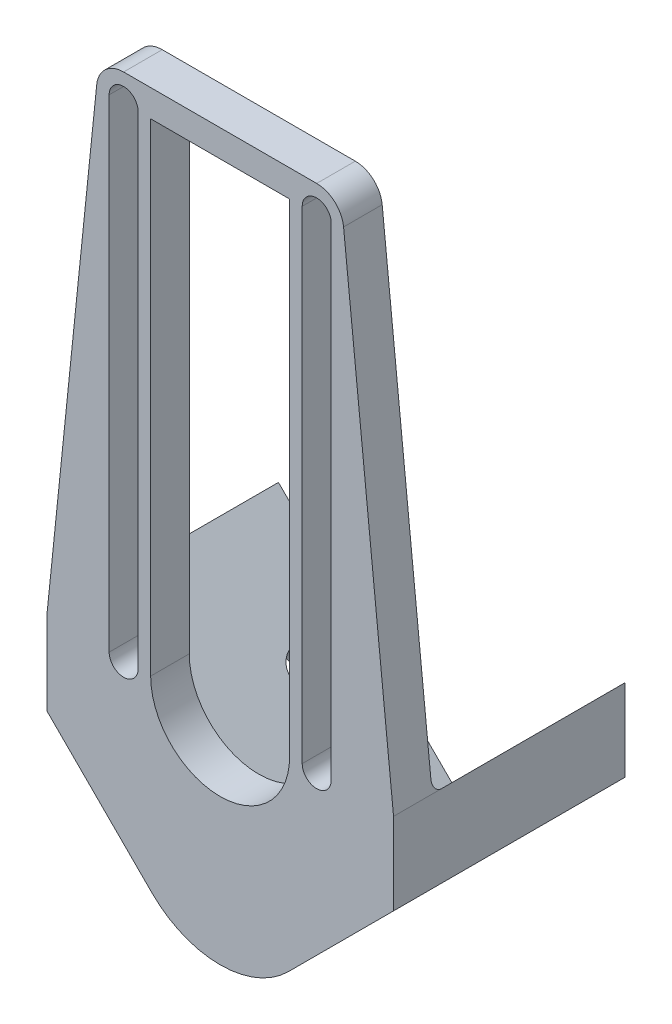
ISO-10303-21;
HEADER;
FILE_DESCRIPTION(('STEP AP214'),'2;1');
FILE_NAME('part.step','',(''),(''),'','','');
FILE_SCHEMA(('AUTOMOTIVE_DESIGN { 1 0 10303 214 1 1 1 1 }'));
ENDSEC;
DATA;
#1=APPLICATION_CONTEXT('core data for automotive mechanical design processes');
#2=APPLICATION_PROTOCOL_DEFINITION('international standard','automotive_design',2000,#1);
#3=PRODUCT_CONTEXT('',#1,'mechanical');
#4=PRODUCT('Part','Part','',(#3));
#5=PRODUCT_RELATED_PRODUCT_CATEGORY('part','',(#4));
#6=PRODUCT_DEFINITION_FORMATION('','',#4);
#7=PRODUCT_DEFINITION_CONTEXT('part definition',#1,'design');
#8=PRODUCT_DEFINITION('design','',#6,#7);
#9=PRODUCT_DEFINITION_SHAPE('','',#8);
#10=(LENGTH_UNIT() NAMED_UNIT(*) SI_UNIT(.MILLI.,.METRE.));
#11=(NAMED_UNIT(*) PLANE_ANGLE_UNIT() SI_UNIT($,.RADIAN.));
#12=(NAMED_UNIT(*) SI_UNIT($,.STERADIAN.) SOLID_ANGLE_UNIT());
#13=UNCERTAINTY_MEASURE_WITH_UNIT(LENGTH_MEASURE(1.E-05),#10,'distance_accuracy_value','');
#14=(GEOMETRIC_REPRESENTATION_CONTEXT(3) GLOBAL_UNCERTAINTY_ASSIGNED_CONTEXT((#13)) GLOBAL_UNIT_ASSIGNED_CONTEXT((#10,
#11,#12)) REPRESENTATION_CONTEXT('',''));
#15=CARTESIAN_POINT('',(0.,0.,0.));
#16=DIRECTION('',(0.,0.,1.));
#17=DIRECTION('',(1.,0.,0.));
#18=AXIS2_PLACEMENT_3D('',#15,#16,#17);
#19=CARTESIAN_POINT('',(-16.8228968081884,1.1376154339499,-14.));
#20=DIRECTION('',(0.707106781186548,0.707106781186546,0.));
#21=DIRECTION('',(-0.707106781186547,0.707106781186549,0.));
#22=AXIS2_PLACEMENT_3D('',#19,#20,#21);
#23=CYLINDRICAL_SURFACE('',#22,1.8);
#24=CARTESIAN_POINT('',(-8.98025612106914,8.98025612106917,-14.));
#25=DIRECTION('',(0.707106781186549,0.707106781186546,0.));
#26=DIRECTION('',(-0.707106781186546,0.707106781186549,0.));
#27=AXIS2_PLACEMENT_3D('',#24,#25,#26);
#28=CIRCLE('',#27,1.8);
#29=CARTESIAN_POINT('',(-10.2530483272049,10.253048327205,-14.));
#30=VERTEX_POINT('',#29);
#31=EDGE_CURVE('E414',#30,#30,#28,.T.);
#32=ORIENTED_EDGE('',*,*,#31,.T.);
#33=EDGE_LOOP('',(#32));
#34=FACE_BOUND('',#33,.T.);
#35=CARTESIAN_POINT('',(-10.3944696834422,7.56604255869607,-14.));
#36=DIRECTION('',(-0.707106781186549,-0.707106781186546,0.));
#37=DIRECTION('',(0.707106781186546,-0.707106781186549,0.));
#38=AXIS2_PLACEMENT_3D('',#35,#36,#37);
#39=CIRCLE('',#38,1.8);
#40=CARTESIAN_POINT('',(-9.12167747730645,6.29325035256029,-14.));
#41=VERTEX_POINT('',#40);
#42=EDGE_CURVE('E40',#41,#41,#39,.F.);
#43=ORIENTED_EDGE('',*,*,#42,.F.);
#44=EDGE_LOOP('',(#43));
#45=FACE_BOUND('',#44,.T.);
#46=ADVANCED_FACE('F36',(#34,#45),#23,.F.);
#47=CARTESIAN_POINT('',(16.8228968081884,1.1376154339499,-14.));
#48=DIRECTION('',(-0.707106781186548,0.707106781186546,0.));
#49=DIRECTION('',(-0.707106781186547,-0.707106781186549,0.));
#50=AXIS2_PLACEMENT_3D('',#47,#48,#49);
#51=CYLINDRICAL_SURFACE('',#50,1.8);
#52=CARTESIAN_POINT('',(8.98025612106914,8.98025612106917,-14.));
#53=DIRECTION('',(-0.707106781186549,0.707106781186546,0.));
#54=DIRECTION('',(-0.707106781186546,-0.707106781186549,0.));
#55=AXIS2_PLACEMENT_3D('',#52,#53,#54);
#56=CIRCLE('',#55,1.8);
#57=CARTESIAN_POINT('',(7.70746391493336,7.70746391493338,-14.));
#58=VERTEX_POINT('',#57);
#59=EDGE_CURVE('E420',#58,#58,#56,.T.);
#60=ORIENTED_EDGE('',*,*,#59,.T.);
#61=EDGE_LOOP('',(#60));
#62=FACE_BOUND('',#61,.T.);
#63=CARTESIAN_POINT('',(10.3944696834422,7.56604255869607,-14.));
#64=DIRECTION('',(0.707106781186549,-0.707106781186546,0.));
#65=DIRECTION('',(0.707106781186546,0.707106781186549,0.));
#66=AXIS2_PLACEMENT_3D('',#63,#64,#65);
#67=CIRCLE('',#66,1.8);
#68=CARTESIAN_POINT('',(11.667261889578,8.83883476483186,-14.));
#69=VERTEX_POINT('',#68);
#70=EDGE_CURVE('E418',#69,#69,#67,.F.);
#71=ORIENTED_EDGE('',*,*,#70,.F.);
#72=EDGE_LOOP('',(#71));
#73=FACE_BOUND('',#72,.T.);
#74=ADVANCED_FACE('F445',(#62,#73),#51,.F.);
#75=CARTESIAN_POINT('',(0.,0.,-20.));
#76=DIRECTION('',(0.707106781186549,0.707106781186546,0.));
#77=DIRECTION('',(-0.707106781186546,0.707106781186549,0.));
#78=AXIS2_PLACEMENT_3D('',#75,#76,#77);
#79=PLANE('',#78);
#80=ORIENTED_EDGE('',*,*,#31,.F.);
#81=EDGE_LOOP('',(#80));
#82=FACE_BOUND('',#81,.T.);
#83=DIRECTION('',(0.,0.,1.));
#84=VECTOR('',#83,1.);
#85=CARTESIAN_POINT('',(-17.9605122421383,17.9605122421383,-20.));
#86=LINE('',#85,#84);
#87=CARTESIAN_POINT('',(-17.9605122421383,17.9605122421383,-20.));
#88=VERTEX_POINT('',#87);
#89=CARTESIAN_POINT('',(-17.9605122421383,17.9605122421383,-1.));
#90=VERTEX_POINT('',#89);
#91=EDGE_CURVE('E383',#88,#90,#86,.T.);
#92=ORIENTED_EDGE('',*,*,#91,.T.);
#93=DIRECTION('',(-0.707106781186546,0.707106781186549,0.));
#94=VECTOR('',#93,1.);
#95=CARTESIAN_POINT('',(0.,0.,-1.));
#96=LINE('',#95,#94);
#97=CARTESIAN_POINT('',(0.,0.,-1.));
#98=VERTEX_POINT('',#97);
#99=EDGE_CURVE('E401',#90,#98,#96,.F.);
#100=ORIENTED_EDGE('',*,*,#99,.T.);
#101=DIRECTION('',(0.,0.,1.));
#102=VECTOR('',#101,1.);
#103=CARTESIAN_POINT('',(0.,0.,-20.));
#104=LINE('',#103,#102);
#105=CARTESIAN_POINT('',(0.,0.,-20.));
#106=VERTEX_POINT('',#105);
#107=EDGE_CURVE('E384',#106,#98,#104,.T.);
#108=ORIENTED_EDGE('',*,*,#107,.F.);
#109=DIRECTION('',(-0.707106781186546,0.707106781186549,0.));
#110=VECTOR('',#109,1.);
#111=CARTESIAN_POINT('',(0.,0.,-20.));
#112=LINE('',#111,#110);
#113=EDGE_CURVE('E341',#106,#88,#112,.T.);
#114=ORIENTED_EDGE('',*,*,#113,.T.);
#115=EDGE_LOOP('',(#92,#100,#108,#114));
#116=FACE_BOUND('',#115,.T.);
#117=ADVANCED_FACE('F441',(#82,#116),#79,.T.);
#118=CARTESIAN_POINT('',(0.,0.,-20.));
#119=DIRECTION('',(0.707106781186549,-0.707106781186546,0.));
#120=DIRECTION('',(0.707106781186546,0.707106781186549,0.));
#121=AXIS2_PLACEMENT_3D('',#118,#119,#120);
#122=PLANE('',#121);
#123=ORIENTED_EDGE('',*,*,#59,.F.);
#124=EDGE_LOOP('',(#123));
#125=FACE_BOUND('',#124,.T.);
#126=ORIENTED_EDGE('',*,*,#107,.T.);
#127=DIRECTION('',(0.707106781186546,0.707106781186549,0.));
#128=VECTOR('',#127,1.);
#129=CARTESIAN_POINT('',(17.9605122421383,17.9605122421383,-1.));
#130=LINE('',#129,#128);
#131=CARTESIAN_POINT('',(17.9605122421383,17.9605122421383,-1.));
#132=VERTEX_POINT('',#131);
#133=EDGE_CURVE('E403',#98,#132,#130,.T.);
#134=ORIENTED_EDGE('',*,*,#133,.T.);
#135=DIRECTION('',(0.,0.,1.));
#136=VECTOR('',#135,1.);
#137=CARTESIAN_POINT('',(17.9605122421383,17.9605122421383,-20.));
#138=LINE('',#137,#136);
#139=CARTESIAN_POINT('',(17.9605122421383,17.9605122421383,-20.));
#140=VERTEX_POINT('',#139);
#141=EDGE_CURVE('E388',#140,#132,#138,.T.);
#142=ORIENTED_EDGE('',*,*,#141,.F.);
#143=DIRECTION('',(0.707106781186546,0.707106781186549,0.));
#144=VECTOR('',#143,1.);
#145=CARTESIAN_POINT('',(0.,0.,-20.));
#146=LINE('',#145,#144);
#147=EDGE_CURVE('E381',#106,#140,#146,.T.);
#148=ORIENTED_EDGE('',*,*,#147,.F.);
#149=EDGE_LOOP('',(#126,#134,#142,#148));
#150=FACE_BOUND('',#149,.T.);
#151=ADVANCED_FACE('F444',(#125,#150),#122,.F.);
#152=CARTESIAN_POINT('',(17.9605122421383,0.,-20.));
#153=DIRECTION('',(-1.,0.,0.));
#154=DIRECTION('',(0.,0.,1.));
#155=AXIS2_PLACEMENT_3D('',#152,#153,#154);
#156=PLANE('',#155);
#157=ORIENTED_EDGE('',*,*,#141,.T.);
#158=DIRECTION('',(0.,0.,-1.));
#159=VECTOR('',#158,1.);
#160=CARTESIAN_POINT('',(17.9605122421383,17.9605122421383,4.));
#161=LINE('',#160,#159);
#162=CARTESIAN_POINT('',(17.9605122421383,17.9605122421383,4.));
#163=VERTEX_POINT('',#162);
#164=EDGE_CURVE('E361',#163,#132,#161,.T.);
#165=ORIENTED_EDGE('',*,*,#164,.F.);
#166=DIRECTION('',(0.,-1.,0.));
#167=VECTOR('',#166,1.);
#168=CARTESIAN_POINT('',(17.9605122421383,0.,4.));
#169=LINE('',#168,#167);
#170=CARTESIAN_POINT('',(17.9605122421383,9.47523086789976,4.));
#171=VERTEX_POINT('',#170);
#172=EDGE_CURVE('E250',#163,#171,#169,.T.);
#173=ORIENTED_EDGE('',*,*,#172,.T.);
#174=DIRECTION('',(0.,0.,1.));
#175=VECTOR('',#174,1.);
#176=CARTESIAN_POINT('',(17.9605122421383,9.47523086789976,-20.));
#177=LINE('',#176,#175);
#178=CARTESIAN_POINT('',(17.9605122421383,9.47523086789976,-20.));
#179=VERTEX_POINT('',#178);
#180=EDGE_CURVE('E391',#179,#171,#177,.T.);
#181=ORIENTED_EDGE('',*,*,#180,.F.);
#182=DIRECTION('',(0.,-1.,0.));
#183=VECTOR('',#182,1.);
#184=CARTESIAN_POINT('',(17.9605122421383,0.,-20.));
#185=LINE('',#184,#183);
#186=EDGE_CURVE('E379',#140,#179,#185,.T.);
#187=ORIENTED_EDGE('',*,*,#186,.F.);
#188=EDGE_LOOP('',(#157,#165,#173,#181,#187));
#189=FACE_BOUND('',#188,.T.);
#190=ADVANCED_FACE('F469',(#189),#156,.F.);
#191=CARTESIAN_POINT('',(4.24264068711929,-4.24264068711928,-20.));
#192=DIRECTION('',(-0.707106781186549,0.707106781186546,0.));
#193=DIRECTION('',(-0.707106781186546,-0.707106781186549,0.));
#194=AXIS2_PLACEMENT_3D('',#191,#192,#193);
#195=PLANE('',#194);
#196=CARTESIAN_POINT('',(13.2228968081884,4.73761543394989,-14.));
#197=DIRECTION('',(0.707106781186549,-0.707106781186546,0.));
#198=DIRECTION('',(0.707106781186546,0.707106781186549,0.));
#199=AXIS2_PLACEMENT_3D('',#196,#197,#198);
#200=CIRCLE('',#199,3.2);
#201=CARTESIAN_POINT('',(15.4856385079854,7.00035713374685,-14.));
#202=VERTEX_POINT('',#201);
#203=EDGE_CURVE('E427',#202,#202,#200,.T.);
#204=ORIENTED_EDGE('',*,*,#203,.F.);
#205=EDGE_LOOP('',(#204));
#206=FACE_BOUND('',#205,.T.);
#207=DIRECTION('',(-0.707106781186546,-0.707106781186549,0.));
#208=VECTOR('',#207,1.);
#209=CARTESIAN_POINT('',(4.24264068711929,-4.24264068711928,4.));
#210=LINE('',#209,#208);
#211=CARTESIAN_POINT('',(7.07106781186549,-1.41421356237307,4.));
#212=VERTEX_POINT('',#211);
#213=EDGE_CURVE('E248',#171,#212,#210,.T.);
#214=ORIENTED_EDGE('',*,*,#213,.T.);
#215=DIRECTION('',(0.,0.,1.));
#216=VECTOR('',#215,1.);
#217=CARTESIAN_POINT('',(7.07106781186549,-1.41421356237307,-20.));
#218=LINE('',#217,#216);
#219=CARTESIAN_POINT('',(7.07106781186549,-1.41421356237307,-20.));
#220=VERTEX_POINT('',#219);
#221=EDGE_CURVE('E45',#212,#220,#218,.F.);
#222=ORIENTED_EDGE('',*,*,#221,.T.);
#223=DIRECTION('',(-0.707106781186546,-0.707106781186549,0.));
#224=VECTOR('',#223,1.);
#225=CARTESIAN_POINT('',(4.24264068711929,-4.24264068711928,-20.));
#226=LINE('',#225,#224);
#227=EDGE_CURVE('E377',#179,#220,#226,.T.);
#228=ORIENTED_EDGE('',*,*,#227,.F.);
#229=ORIENTED_EDGE('',*,*,#180,.T.);
#230=EDGE_LOOP('',(#214,#222,#228,#229));
#231=FACE_BOUND('',#230,.T.);
#232=ADVANCED_FACE('F575',(#206,#231),#195,.F.);
#233=CARTESIAN_POINT('',(-4.24264068711929,-4.24264068711928,-20.));
#234=DIRECTION('',(-0.707106781186549,-0.707106781186546,0.));
#235=DIRECTION('',(0.707106781186546,-0.707106781186549,0.));
#236=AXIS2_PLACEMENT_3D('',#233,#234,#235);
#237=PLANE('',#236);
#238=CARTESIAN_POINT('',(-13.2228968081884,4.73761543394989,-14.));
#239=DIRECTION('',(-0.707106781186549,-0.707106781186546,0.));
#240=DIRECTION('',(0.707106781186546,-0.707106781186549,0.));
#241=AXIS2_PLACEMENT_3D('',#238,#239,#240);
#242=CIRCLE('',#241,3.2);
#243=CARTESIAN_POINT('',(-10.9601551083915,2.47487373415294,-14.));
#244=VERTEX_POINT('',#243);
#245=EDGE_CURVE('E434',#244,#244,#242,.T.);
#246=ORIENTED_EDGE('',*,*,#245,.F.);
#247=EDGE_LOOP('',(#246));
#248=FACE_BOUND('',#247,.T.);
#249=DIRECTION('',(0.707106781186546,-0.707106781186549,0.));
#250=VECTOR('',#249,1.);
#251=CARTESIAN_POINT('',(-4.24264068711929,-4.24264068711928,-20.));
#252=LINE('',#251,#250);
#253=CARTESIAN_POINT('',(-17.9605122421383,9.47523086789976,-20.));
#254=VERTEX_POINT('',#253);
#255=CARTESIAN_POINT('',(-7.07106781186549,-1.41421356237307,-20.));
#256=VERTEX_POINT('',#255);
#257=EDGE_CURVE('E374',#254,#256,#252,.T.);
#258=ORIENTED_EDGE('',*,*,#257,.T.);
#259=DIRECTION('',(0.,0.,1.));
#260=VECTOR('',#259,1.);
#261=CARTESIAN_POINT('',(-7.07106781186549,-1.41421356237307,4.));
#262=LINE('',#261,#260);
#263=CARTESIAN_POINT('',(-7.07106781186549,-1.41421356237307,4.));
#264=VERTEX_POINT('',#263);
#265=EDGE_CURVE('E411',#256,#264,#262,.T.);
#266=ORIENTED_EDGE('',*,*,#265,.T.);
#267=DIRECTION('',(0.707106781186546,-0.707106781186549,0.));
#268=VECTOR('',#267,1.);
#269=CARTESIAN_POINT('',(-4.24264068711929,-4.24264068711928,4.));
#270=LINE('',#269,#268);
#271=CARTESIAN_POINT('',(-17.9605122421383,9.47523086789976,4.));
#272=VERTEX_POINT('',#271);
#273=EDGE_CURVE('E246',#272,#264,#270,.T.);
#274=ORIENTED_EDGE('',*,*,#273,.F.);
#275=DIRECTION('',(0.,0.,1.));
#276=VECTOR('',#275,1.);
#277=CARTESIAN_POINT('',(-17.9605122421383,9.47523086789976,-20.));
#278=LINE('',#277,#276);
#279=EDGE_CURVE('E393',#254,#272,#278,.T.);
#280=ORIENTED_EDGE('',*,*,#279,.F.);
#281=EDGE_LOOP('',(#258,#266,#274,#280));
#282=FACE_BOUND('',#281,.T.);
#283=ADVANCED_FACE('F479',(#248,#282),#237,.T.);
#284=CARTESIAN_POINT('',(-17.9605122421383,0.,-20.));
#285=DIRECTION('',(-1.,0.,0.));
#286=DIRECTION('',(0.,0.,1.));
#287=AXIS2_PLACEMENT_3D('',#284,#285,#286);
#288=PLANE('',#287);
#289=ORIENTED_EDGE('',*,*,#279,.T.);
#290=DIRECTION('',(0.,-1.,0.));
#291=VECTOR('',#290,1.);
#292=CARTESIAN_POINT('',(-17.9605122421383,0.,4.));
#293=LINE('',#292,#291);
#294=CARTESIAN_POINT('',(-17.9605122421383,17.9605122421383,4.));
#295=VERTEX_POINT('',#294);
#296=EDGE_CURVE('E243',#295,#272,#293,.T.);
#297=ORIENTED_EDGE('',*,*,#296,.F.);
#298=DIRECTION('',(0.,0.,-1.));
#299=VECTOR('',#298,1.);
#300=CARTESIAN_POINT('',(-17.9605122421383,17.9605122421383,4.));
#301=LINE('',#300,#299);
#302=EDGE_CURVE('E363',#295,#90,#301,.T.);
#303=ORIENTED_EDGE('',*,*,#302,.T.);
#304=ORIENTED_EDGE('',*,*,#91,.F.);
#305=DIRECTION('',(0.,-1.,0.));
#306=VECTOR('',#305,1.);
#307=CARTESIAN_POINT('',(-17.9605122421383,0.,-20.));
#308=LINE('',#307,#306);
#309=EDGE_CURVE('E371',#88,#254,#308,.T.);
#310=ORIENTED_EDGE('',*,*,#309,.T.);
#311=EDGE_LOOP('',(#289,#297,#303,#304,#310));
#312=FACE_BOUND('',#311,.T.);
#313=ADVANCED_FACE('F475',(#312),#288,.T.);
#314=CARTESIAN_POINT('',(0.,0.,-20.));
#315=DIRECTION('',(0.,0.,1.));
#316=DIRECTION('',(1.,0.,0.));
#317=AXIS2_PLACEMENT_3D('',#314,#315,#316);
#318=PLANE('',#317);
#319=ORIENTED_EDGE('',*,*,#227,.T.);
#320=CARTESIAN_POINT('',(0.,5.6568542494924,-20.));
#321=DIRECTION('',(0.,0.,1.));
#322=DIRECTION('',(1.,0.,0.));
#323=AXIS2_PLACEMENT_3D('',#320,#321,#322);
#324=CIRCLE('',#323,10.);
#325=EDGE_CURVE('E11',#220,#256,#324,.F.);
#326=ORIENTED_EDGE('',*,*,#325,.T.);
#327=ORIENTED_EDGE('',*,*,#257,.F.);
#328=ORIENTED_EDGE('',*,*,#309,.F.);
#329=ORIENTED_EDGE('',*,*,#113,.F.);
#330=ORIENTED_EDGE('',*,*,#147,.T.);
#331=ORIENTED_EDGE('',*,*,#186,.T.);
#332=EDGE_LOOP('',(#319,#326,#327,#328,#329,#330,#331));
#333=FACE_BOUND('',#332,.T.);
#334=ADVANCED_FACE('F472',(#333),#318,.F.);
#335=CARTESIAN_POINT('',(0.,0.,0.));
#336=DIRECTION('',(0.,0.,1.));
#337=DIRECTION('',(1.,0.,0.));
#338=AXIS2_PLACEMENT_3D('',#335,#336,#337);
#339=PLANE('',#338);
#340=DIRECTION('',(1.,0.,0.));
#341=VECTOR('',#340,1.);
#342=CARTESIAN_POINT('',(0.,67.9605122421383,0.));
#343=LINE('',#342,#341);
#344=CARTESIAN_POINT('',(-7.2,67.9605122421383,0.));
#345=VERTEX_POINT('',#344);
#346=CARTESIAN_POINT('',(7.2,67.9605122421383,0.));
#347=VERTEX_POINT('',#346);
#348=EDGE_CURVE('E298',#345,#347,#343,.T.);
#349=ORIENTED_EDGE('',*,*,#348,.F.);
#350=DIRECTION('',(0.,-1.,0.));
#351=VECTOR('',#350,1.);
#352=CARTESIAN_POINT('',(-7.2,0.,0.));
#353=LINE('',#352,#351);
#354=CARTESIAN_POINT('',(-7.2,17.9605122421383,0.));
#355=VERTEX_POINT('',#354);
#356=EDGE_CURVE('E306',#345,#355,#353,.T.);
#357=ORIENTED_EDGE('',*,*,#356,.T.);
#358=CARTESIAN_POINT('',(0.,17.9605122421383,0.));
#359=DIRECTION('',(0.,0.,1.));
#360=DIRECTION('',(1.,0.,0.));
#361=AXIS2_PLACEMENT_3D('',#358,#359,#360);
#362=CIRCLE('',#361,7.2);
#363=CARTESIAN_POINT('',(7.2,17.9605122421383,0.));
#364=VERTEX_POINT('',#363);
#365=EDGE_CURVE('E303',#364,#355,#362,.F.);
#366=ORIENTED_EDGE('',*,*,#365,.F.);
#367=DIRECTION('',(0.,-1.,0.));
#368=VECTOR('',#367,1.);
#369=CARTESIAN_POINT('',(7.2,0.,0.));
#370=LINE('',#369,#368);
#371=EDGE_CURVE('E301',#347,#364,#370,.T.);
#372=ORIENTED_EDGE('',*,*,#371,.F.);
#373=EDGE_LOOP('',(#349,#357,#366,#372));
#374=FACE_BOUND('',#373,.T.);
#375=DIRECTION('',(0.,-1.,0.));
#376=VECTOR('',#375,1.);
#377=CARTESIAN_POINT('',(-11.5,0.,0.));
#378=LINE('',#377,#376);
#379=CARTESIAN_POINT('',(-11.5,67.9605122421383,0.));
#380=VERTEX_POINT('',#379);
#381=CARTESIAN_POINT('',(-11.5,17.9605122421383,0.));
#382=VERTEX_POINT('',#381);
#383=EDGE_CURVE('E309',#380,#382,#378,.T.);
#384=ORIENTED_EDGE('',*,*,#383,.T.);
#385=CARTESIAN_POINT('',(-10.,17.9605122421383,0.));
#386=DIRECTION('',(0.,0.,1.));
#387=DIRECTION('',(1.,0.,0.));
#388=AXIS2_PLACEMENT_3D('',#385,#386,#387);
#389=CIRCLE('',#388,1.5);
#390=CARTESIAN_POINT('',(-8.5,17.9605122421383,0.));
#391=VERTEX_POINT('',#390);
#392=EDGE_CURVE('E318',#391,#382,#389,.F.);
#393=ORIENTED_EDGE('',*,*,#392,.F.);
#394=DIRECTION('',(0.,-1.,0.));
#395=VECTOR('',#394,1.);
#396=CARTESIAN_POINT('',(-8.5,0.,0.));
#397=LINE('',#396,#395);
#398=CARTESIAN_POINT('',(-8.49999999999999,67.9605122421383,0.));
#399=VERTEX_POINT('',#398);
#400=EDGE_CURVE('E315',#399,#391,#397,.T.);
#401=ORIENTED_EDGE('',*,*,#400,.F.);
#402=CARTESIAN_POINT('',(-10.,67.9605122421383,0.));
#403=DIRECTION('',(0.,0.,1.));
#404=DIRECTION('',(1.,0.,0.));
#405=AXIS2_PLACEMENT_3D('',#402,#403,#404);
#406=CIRCLE('',#405,1.5);
#407=EDGE_CURVE('E312',#380,#399,#406,.F.);
#408=ORIENTED_EDGE('',*,*,#407,.F.);
#409=EDGE_LOOP('',(#384,#393,#401,#408));
#410=FACE_BOUND('',#409,.T.);
#411=CARTESIAN_POINT('',(10.,67.9605122421383,0.));
#412=DIRECTION('',(0.,0.,1.));
#413=DIRECTION('',(1.,0.,0.));
#414=AXIS2_PLACEMENT_3D('',#411,#412,#413);
#415=CIRCLE('',#414,1.5);
#416=CARTESIAN_POINT('',(11.5,67.9605122421383,0.));
#417=VERTEX_POINT('',#416);
#418=CARTESIAN_POINT('',(8.49999999999999,67.9605122421383,0.));
#419=VERTEX_POINT('',#418);
#420=EDGE_CURVE('E321',#417,#419,#415,.T.);
#421=ORIENTED_EDGE('',*,*,#420,.T.);
#422=DIRECTION('',(0.,-1.,0.));
#423=VECTOR('',#422,1.);
#424=CARTESIAN_POINT('',(8.5,0.,0.));
#425=LINE('',#424,#423);
#426=CARTESIAN_POINT('',(8.5,17.9605122421383,0.));
#427=VERTEX_POINT('',#426);
#428=EDGE_CURVE('E221',#419,#427,#425,.T.);
#429=ORIENTED_EDGE('',*,*,#428,.T.);
#430=CARTESIAN_POINT('',(10.,17.9605122421383,0.));
#431=DIRECTION('',(0.,0.,1.));
#432=DIRECTION('',(1.,0.,0.));
#433=AXIS2_PLACEMENT_3D('',#430,#431,#432);
#434=CIRCLE('',#433,1.5);
#435=CARTESIAN_POINT('',(11.5,17.9605122421383,0.));
#436=VERTEX_POINT('',#435);
#437=EDGE_CURVE('E327',#427,#436,#434,.T.);
#438=ORIENTED_EDGE('',*,*,#437,.T.);
#439=DIRECTION('',(0.,-1.,0.));
#440=VECTOR('',#439,1.);
#441=CARTESIAN_POINT('',(11.5,0.,0.));
#442=LINE('',#441,#440);
#443=EDGE_CURVE('E324',#417,#436,#442,.T.);
#444=ORIENTED_EDGE('',*,*,#443,.F.);
#445=EDGE_LOOP('',(#421,#429,#438,#444));
#446=FACE_BOUND('',#445,.T.);
#447=DIRECTION('',(0.707106781186546,0.707106781186549,0.));
#448=VECTOR('',#447,1.);
#449=CARTESIAN_POINT('',(-0.707106781186549,0.707106781186547,0.));
#450=LINE('',#449,#448);
#451=CARTESIAN_POINT('',(17.8285500279479,19.2427635903211,0.));
#452=VERTEX_POINT('',#451);
#453=CARTESIAN_POINT('',(0.,1.4142135623731,0.));
#454=VERTEX_POINT('',#453);
#455=EDGE_CURVE('E387',#452,#454,#450,.F.);
#456=ORIENTED_EDGE('',*,*,#455,.T.);
#457=DIRECTION('',(-0.707106781186546,0.707106781186549,0.));
#458=VECTOR('',#457,1.);
#459=CARTESIAN_POINT('',(0.707106781186548,0.707106781186546,0.));
#460=LINE('',#459,#458);
#461=CARTESIAN_POINT('',(-17.8285500279479,19.2427635903211,0.));
#462=VERTEX_POINT('',#461);
#463=EDGE_CURVE('E398',#454,#462,#460,.T.);
#464=ORIENTED_EDGE('',*,*,#463,.T.);
#465=DIRECTION('',(0.102373754998335,0.994746004911576,0.));
#466=VECTOR('',#465,1.);
#467=CARTESIAN_POINT('',(-19.6013037837895,2.01725773343315,0.));
#468=LINE('',#467,#466);
#469=CARTESIAN_POINT('',(-12.7852888137524,68.2471587561337,0.));
#470=VERTEX_POINT('',#469);
#471=EDGE_CURVE('E294',#462,#470,#468,.T.);
#472=ORIENTED_EDGE('',*,*,#471,.T.);
#473=CARTESIAN_POINT('',(-10.,67.9605122421383,0.));
#474=DIRECTION('',(0.,0.,1.));
#475=DIRECTION('',(1.,0.,0.));
#476=AXIS2_PLACEMENT_3D('',#473,#474,#475);
#477=CIRCLE('',#476,2.8);
#478=CARTESIAN_POINT('',(-10.,70.7605122421383,0.));
#479=VERTEX_POINT('',#478);
#480=EDGE_CURVE('E291',#470,#479,#477,.F.);
#481=ORIENTED_EDGE('',*,*,#480,.T.);
#482=DIRECTION('',(1.,0.,0.));
#483=VECTOR('',#482,1.);
#484=CARTESIAN_POINT('',(0.,70.7605122421383,0.));
#485=LINE('',#484,#483);
#486=CARTESIAN_POINT('',(10.,70.7605122421383,0.));
#487=VERTEX_POINT('',#486);
#488=EDGE_CURVE('E288',#479,#487,#485,.T.);
#489=ORIENTED_EDGE('',*,*,#488,.T.);
#490=CARTESIAN_POINT('',(10.,67.9605122421383,0.));
#491=DIRECTION('',(0.,0.,1.));
#492=DIRECTION('',(1.,0.,0.));
#493=AXIS2_PLACEMENT_3D('',#490,#491,#492);
#494=CIRCLE('',#493,2.8);
#495=CARTESIAN_POINT('',(12.7852888137524,68.2471587561337,0.));
#496=VERTEX_POINT('',#495);
#497=EDGE_CURVE('E227',#496,#487,#494,.T.);
#498=ORIENTED_EDGE('',*,*,#497,.F.);
#499=DIRECTION('',(-0.102373754998335,0.994746004911576,0.));
#500=VECTOR('',#499,1.);
#501=CARTESIAN_POINT('',(19.6013037837895,2.01725773343314,0.));
#502=LINE('',#501,#500);
#503=EDGE_CURVE('E296',#452,#496,#502,.T.);
#504=ORIENTED_EDGE('',*,*,#503,.F.);
#505=EDGE_LOOP('',(#456,#464,#472,#481,#489,#498,#504));
#506=FACE_BOUND('',#505,.T.);
#507=ADVANCED_FACE('F503',(#374,#410,#446,#506),#339,.F.);
#508=CARTESIAN_POINT('',(10.,67.9605122421383,4.));
#509=DIRECTION('',(0.,0.,-1.));
#510=DIRECTION('',(-1.,0.,0.));
#511=AXIS2_PLACEMENT_3D('',#508,#509,#510);
#512=CYLINDRICAL_SURFACE('',#511,1.5);
#513=ORIENTED_EDGE('',*,*,#420,.F.);
#514=DIRECTION('',(0.,0.,-1.));
#515=VECTOR('',#514,1.);
#516=CARTESIAN_POINT('',(11.5,67.9605122421383,4.));
#517=LINE('',#516,#515);
#518=CARTESIAN_POINT('',(11.5,67.9605122421383,4.));
#519=VERTEX_POINT('',#518);
#520=EDGE_CURVE('E339',#519,#417,#517,.T.);
#521=ORIENTED_EDGE('',*,*,#520,.F.);
#522=CARTESIAN_POINT('',(10.,67.9605122421383,4.));
#523=DIRECTION('',(0.,0.,1.));
#524=DIRECTION('',(1.,0.,0.));
#525=AXIS2_PLACEMENT_3D('',#522,#523,#524);
#526=CIRCLE('',#525,1.5);
#527=CARTESIAN_POINT('',(8.49999999999999,67.9605122421383,4.));
#528=VERTEX_POINT('',#527);
#529=EDGE_CURVE('E275',#519,#528,#526,.T.);
#530=ORIENTED_EDGE('',*,*,#529,.T.);
#531=DIRECTION('',(0.,0.,-1.));
#532=VECTOR('',#531,1.);
#533=CARTESIAN_POINT('',(8.49999999999999,67.9605122421383,4.));
#534=LINE('',#533,#532);
#535=EDGE_CURVE('E332',#528,#419,#534,.T.);
#536=ORIENTED_EDGE('',*,*,#535,.T.);
#537=EDGE_LOOP('',(#513,#521,#530,#536));
#538=FACE_BOUND('',#537,.T.);
#539=ADVANCED_FACE('F506',(#538),#512,.F.);
#540=CARTESIAN_POINT('',(11.5,0.,4.));
#541=DIRECTION('',(1.,0.,0.));
#542=DIRECTION('',(0.,1.,0.));
#543=AXIS2_PLACEMENT_3D('',#540,#541,#542);
#544=PLANE('',#543);
#545=ORIENTED_EDGE('',*,*,#443,.T.);
#546=DIRECTION('',(0.,0.,-1.));
#547=VECTOR('',#546,1.);
#548=CARTESIAN_POINT('',(11.5,17.9605122421383,4.));
#549=LINE('',#548,#547);
#550=CARTESIAN_POINT('',(11.5,17.9605122421383,4.));
#551=VERTEX_POINT('',#550);
#552=EDGE_CURVE('E337',#551,#436,#549,.T.);
#553=ORIENTED_EDGE('',*,*,#552,.F.);
#554=DIRECTION('',(0.,-1.,0.));
#555=VECTOR('',#554,1.);
#556=CARTESIAN_POINT('',(11.5,0.,4.));
#557=LINE('',#556,#555);
#558=EDGE_CURVE('E278',#519,#551,#557,.T.);
#559=ORIENTED_EDGE('',*,*,#558,.F.);
#560=ORIENTED_EDGE('',*,*,#520,.T.);
#561=EDGE_LOOP('',(#545,#553,#559,#560));
#562=FACE_BOUND('',#561,.T.);
#563=ADVANCED_FACE('F516',(#562),#544,.F.);
#564=CARTESIAN_POINT('',(10.,17.9605122421383,4.));
#565=DIRECTION('',(0.,0.,-1.));
#566=DIRECTION('',(-1.,0.,0.));
#567=AXIS2_PLACEMENT_3D('',#564,#565,#566);
#568=CYLINDRICAL_SURFACE('',#567,1.5);
#569=ORIENTED_EDGE('',*,*,#437,.F.);
#570=DIRECTION('',(0.,0.,-1.));
#571=VECTOR('',#570,1.);
#572=CARTESIAN_POINT('',(8.5,17.9605122421383,4.));
#573=LINE('',#572,#571);
#574=CARTESIAN_POINT('',(8.5,17.9605122421383,4.));
#575=VERTEX_POINT('',#574);
#576=EDGE_CURVE('E334',#575,#427,#573,.T.);
#577=ORIENTED_EDGE('',*,*,#576,.F.);
#578=CARTESIAN_POINT('',(10.,17.9605122421383,4.));
#579=DIRECTION('',(0.,0.,1.));
#580=DIRECTION('',(1.,0.,0.));
#581=AXIS2_PLACEMENT_3D('',#578,#579,#580);
#582=CIRCLE('',#581,1.5);
#583=EDGE_CURVE('E280',#575,#551,#582,.T.);
#584=ORIENTED_EDGE('',*,*,#583,.T.);
#585=ORIENTED_EDGE('',*,*,#552,.T.);
#586=EDGE_LOOP('',(#569,#577,#584,#585));
#587=FACE_BOUND('',#586,.T.);
#588=ADVANCED_FACE('F512',(#587),#568,.F.);
#589=CARTESIAN_POINT('',(-11.5,0.,4.));
#590=DIRECTION('',(1.,0.,0.));
#591=DIRECTION('',(0.,1.,0.));
#592=AXIS2_PLACEMENT_3D('',#589,#590,#591);
#593=PLANE('',#592);
#594=ORIENTED_EDGE('',*,*,#383,.F.);
#595=DIRECTION('',(0.,0.,-1.));
#596=VECTOR('',#595,1.);
#597=CARTESIAN_POINT('',(-11.5,67.9605122421383,4.));
#598=LINE('',#597,#596);
#599=CARTESIAN_POINT('',(-11.5,67.9605122421383,4.));
#600=VERTEX_POINT('',#599);
#601=EDGE_CURVE('E335',#600,#380,#598,.T.);
#602=ORIENTED_EDGE('',*,*,#601,.F.);
#603=DIRECTION('',(0.,-1.,0.));
#604=VECTOR('',#603,1.);
#605=CARTESIAN_POINT('',(-11.5,0.,4.));
#606=LINE('',#605,#604);
#607=CARTESIAN_POINT('',(-11.5,17.9605122421383,4.));
#608=VERTEX_POINT('',#607);
#609=EDGE_CURVE('E264',#600,#608,#606,.T.);
#610=ORIENTED_EDGE('',*,*,#609,.T.);
#611=DIRECTION('',(0.,0.,-1.));
#612=VECTOR('',#611,1.);
#613=CARTESIAN_POINT('',(-11.5,17.9605122421383,4.));
#614=LINE('',#613,#612);
#615=EDGE_CURVE('E342',#608,#382,#614,.T.);
#616=ORIENTED_EDGE('',*,*,#615,.T.);
#617=EDGE_LOOP('',(#594,#602,#610,#616));
#618=FACE_BOUND('',#617,.T.);
#619=ADVANCED_FACE('F515',(#618),#593,.T.);
#620=CARTESIAN_POINT('',(-10.,67.9605122421383,4.));
#621=DIRECTION('',(0.,0.,-1.));
#622=DIRECTION('',(-1.,0.,0.));
#623=AXIS2_PLACEMENT_3D('',#620,#621,#622);
#624=CYLINDRICAL_SURFACE('',#623,1.5);
#625=ORIENTED_EDGE('',*,*,#407,.T.);
#626=DIRECTION('',(0.,0.,-1.));
#627=VECTOR('',#626,1.);
#628=CARTESIAN_POINT('',(-8.49999999999999,67.9605122421383,4.));
#629=LINE('',#628,#627);
#630=CARTESIAN_POINT('',(-8.49999999999999,67.9605122421383,4.));
#631=VERTEX_POINT('',#630);
#632=EDGE_CURVE('E348',#631,#399,#629,.T.);
#633=ORIENTED_EDGE('',*,*,#632,.F.);
#634=CARTESIAN_POINT('',(-10.,67.9605122421383,4.));
#635=DIRECTION('',(0.,0.,1.));
#636=DIRECTION('',(1.,0.,0.));
#637=AXIS2_PLACEMENT_3D('',#634,#635,#636);
#638=CIRCLE('',#637,1.5);
#639=EDGE_CURVE('E267',#600,#631,#638,.F.);
#640=ORIENTED_EDGE('',*,*,#639,.F.);
#641=ORIENTED_EDGE('',*,*,#601,.T.);
#642=EDGE_LOOP('',(#625,#633,#640,#641));
#643=FACE_BOUND('',#642,.T.);
#644=ADVANCED_FACE('F533',(#643),#624,.F.);
#645=CARTESIAN_POINT('',(-8.5,0.,4.));
#646=DIRECTION('',(1.,0.,0.));
#647=DIRECTION('',(0.,1.,0.));
#648=AXIS2_PLACEMENT_3D('',#645,#646,#647);
#649=PLANE('',#648);
#650=ORIENTED_EDGE('',*,*,#400,.T.);
#651=DIRECTION('',(0.,0.,-1.));
#652=VECTOR('',#651,1.);
#653=CARTESIAN_POINT('',(-8.5,17.9605122421383,4.));
#654=LINE('',#653,#652);
#655=CARTESIAN_POINT('',(-8.5,17.9605122421383,4.));
#656=VERTEX_POINT('',#655);
#657=EDGE_CURVE('E344',#656,#391,#654,.T.);
#658=ORIENTED_EDGE('',*,*,#657,.F.);
#659=DIRECTION('',(0.,-1.,0.));
#660=VECTOR('',#659,1.);
#661=CARTESIAN_POINT('',(-8.5,0.,4.));
#662=LINE('',#661,#660);
#663=EDGE_CURVE('E270',#631,#656,#662,.T.);
#664=ORIENTED_EDGE('',*,*,#663,.F.);
#665=ORIENTED_EDGE('',*,*,#632,.T.);
#666=EDGE_LOOP('',(#650,#658,#664,#665));
#667=FACE_BOUND('',#666,.T.);
#668=ADVANCED_FACE('F529',(#667),#649,.F.);
#669=CARTESIAN_POINT('',(0.,67.9605122421383,4.));
#670=DIRECTION('',(0.,1.,0.));
#671=DIRECTION('',(0.,0.,1.));
#672=AXIS2_PLACEMENT_3D('',#669,#670,#671);
#673=PLANE('',#672);
#674=ORIENTED_EDGE('',*,*,#348,.T.);
#675=DIRECTION('',(0.,0.,-1.));
#676=VECTOR('',#675,1.);
#677=CARTESIAN_POINT('',(7.2,67.9605122421383,4.));
#678=LINE('',#677,#676);
#679=CARTESIAN_POINT('',(7.2,67.9605122421383,4.));
#680=VERTEX_POINT('',#679);
#681=EDGE_CURVE('E345',#680,#347,#678,.T.);
#682=ORIENTED_EDGE('',*,*,#681,.F.);
#683=DIRECTION('',(1.,0.,0.));
#684=VECTOR('',#683,1.);
#685=CARTESIAN_POINT('',(0.,67.9605122421383,4.));
#686=LINE('',#685,#684);
#687=CARTESIAN_POINT('',(-7.2,67.9605122421383,4.));
#688=VERTEX_POINT('',#687);
#689=EDGE_CURVE('E254',#688,#680,#686,.T.);
#690=ORIENTED_EDGE('',*,*,#689,.F.);
#691=DIRECTION('',(0.,0.,-1.));
#692=VECTOR('',#691,1.);
#693=CARTESIAN_POINT('',(-7.2,67.9605122421383,4.));
#694=LINE('',#693,#692);
#695=EDGE_CURVE('E231',#688,#345,#694,.T.);
#696=ORIENTED_EDGE('',*,*,#695,.T.);
#697=EDGE_LOOP('',(#674,#682,#690,#696));
#698=FACE_BOUND('',#697,.T.);
#699=ADVANCED_FACE('F532',(#698),#673,.F.);
#700=CARTESIAN_POINT('',(7.2,0.,4.));
#701=DIRECTION('',(1.,0.,0.));
#702=DIRECTION('',(0.,1.,0.));
#703=AXIS2_PLACEMENT_3D('',#700,#701,#702);
#704=PLANE('',#703);
#705=ORIENTED_EDGE('',*,*,#371,.T.);
#706=DIRECTION('',(0.,0.,-1.));
#707=VECTOR('',#706,1.);
#708=CARTESIAN_POINT('',(7.2,17.9605122421383,4.));
#709=LINE('',#708,#707);
#710=CARTESIAN_POINT('',(7.2,17.9605122421383,4.));
#711=VERTEX_POINT('',#710);
#712=EDGE_CURVE('E355',#711,#364,#709,.T.);
#713=ORIENTED_EDGE('',*,*,#712,.F.);
#714=DIRECTION('',(0.,-1.,0.));
#715=VECTOR('',#714,1.);
#716=CARTESIAN_POINT('',(7.2,0.,4.));
#717=LINE('',#716,#715);
#718=EDGE_CURVE('E257',#680,#711,#717,.T.);
#719=ORIENTED_EDGE('',*,*,#718,.F.);
#720=ORIENTED_EDGE('',*,*,#681,.T.);
#721=EDGE_LOOP('',(#705,#713,#719,#720));
#722=FACE_BOUND('',#721,.T.);
#723=ADVANCED_FACE('F547',(#722),#704,.F.);
#724=CARTESIAN_POINT('',(0.,17.9605122421383,4.));
#725=DIRECTION('',(0.,0.,-1.));
#726=DIRECTION('',(-1.,0.,0.));
#727=AXIS2_PLACEMENT_3D('',#724,#725,#726);
#728=CYLINDRICAL_SURFACE('',#727,7.2);
#729=ORIENTED_EDGE('',*,*,#365,.T.);
#730=DIRECTION('',(0.,0.,-1.));
#731=VECTOR('',#730,1.);
#732=CARTESIAN_POINT('',(-7.2,17.9605122421383,4.));
#733=LINE('',#732,#731);
#734=CARTESIAN_POINT('',(-7.2,17.9605122421383,4.));
#735=VERTEX_POINT('',#734);
#736=EDGE_CURVE('E353',#735,#355,#733,.T.);
#737=ORIENTED_EDGE('',*,*,#736,.F.);
#738=CARTESIAN_POINT('',(0.,17.9605122421383,4.));
#739=DIRECTION('',(0.,0.,1.));
#740=DIRECTION('',(1.,0.,0.));
#741=AXIS2_PLACEMENT_3D('',#738,#739,#740);
#742=CIRCLE('',#741,7.2);
#743=EDGE_CURVE('E259',#711,#735,#742,.F.);
#744=ORIENTED_EDGE('',*,*,#743,.F.);
#745=ORIENTED_EDGE('',*,*,#712,.T.);
#746=EDGE_LOOP('',(#729,#737,#744,#745));
#747=FACE_BOUND('',#746,.T.);
#748=ADVANCED_FACE('F544',(#747),#728,.F.);
#749=CARTESIAN_POINT('',(10.,67.9605122421383,4.));
#750=DIRECTION('',(0.,0.,-1.));
#751=DIRECTION('',(-1.,0.,0.));
#752=AXIS2_PLACEMENT_3D('',#749,#750,#751);
#753=CYLINDRICAL_SURFACE('',#752,2.8);
#754=ORIENTED_EDGE('',*,*,#497,.T.);
#755=DIRECTION('',(0.,0.,-1.));
#756=VECTOR('',#755,1.);
#757=CARTESIAN_POINT('',(10.,70.7605122421383,4.));
#758=LINE('',#757,#756);
#759=CARTESIAN_POINT('',(10.,70.7605122421383,4.));
#760=VERTEX_POINT('',#759);
#761=EDGE_CURVE('E224',#760,#487,#758,.T.);
#762=ORIENTED_EDGE('',*,*,#761,.F.);
#763=CARTESIAN_POINT('',(10.,67.9605122421383,4.));
#764=DIRECTION('',(0.,0.,1.));
#765=DIRECTION('',(1.,0.,0.));
#766=AXIS2_PLACEMENT_3D('',#763,#764,#765);
#767=CIRCLE('',#766,2.8);
#768=CARTESIAN_POINT('',(12.7852888137524,68.2471587561337,4.));
#769=VERTEX_POINT('',#768);
#770=EDGE_CURVE('E207',#769,#760,#767,.T.);
#771=ORIENTED_EDGE('',*,*,#770,.F.);
#772=DIRECTION('',(0.,0.,-1.));
#773=VECTOR('',#772,1.);
#774=CARTESIAN_POINT('',(12.7852888137524,68.2471587561337,4.));
#775=LINE('',#774,#773);
#776=EDGE_CURVE('E286',#769,#496,#775,.T.);
#777=ORIENTED_EDGE('',*,*,#776,.T.);
#778=EDGE_LOOP('',(#754,#762,#771,#777));
#779=FACE_BOUND('',#778,.T.);
#780=ADVANCED_FACE('F225',(#779),#753,.T.);
#781=CARTESIAN_POINT('',(0.,70.7605122421383,4.));
#782=DIRECTION('',(0.,1.,0.));
#783=DIRECTION('',(0.,0.,1.));
#784=AXIS2_PLACEMENT_3D('',#781,#782,#783);
#785=PLANE('',#784);
#786=ORIENTED_EDGE('',*,*,#488,.F.);
#787=DIRECTION('',(0.,0.,-1.));
#788=VECTOR('',#787,1.);
#789=CARTESIAN_POINT('',(-10.,70.7605122421383,4.));
#790=LINE('',#789,#788);
#791=CARTESIAN_POINT('',(-10.,70.7605122421383,4.));
#792=VERTEX_POINT('',#791);
#793=EDGE_CURVE('E232',#792,#479,#790,.T.);
#794=ORIENTED_EDGE('',*,*,#793,.F.);
#795=DIRECTION('',(1.,0.,0.));
#796=VECTOR('',#795,1.);
#797=CARTESIAN_POINT('',(0.,70.7605122421383,4.));
#798=LINE('',#797,#796);
#799=EDGE_CURVE('E213',#792,#760,#798,.T.);
#800=ORIENTED_EDGE('',*,*,#799,.T.);
#801=ORIENTED_EDGE('',*,*,#761,.T.);
#802=EDGE_LOOP('',(#786,#794,#800,#801));
#803=FACE_BOUND('',#802,.T.);
#804=ADVANCED_FACE('F234',(#803),#785,.T.);
#805=CARTESIAN_POINT('',(-10.,67.9605122421383,4.));
#806=DIRECTION('',(0.,0.,-1.));
#807=DIRECTION('',(-1.,0.,0.));
#808=AXIS2_PLACEMENT_3D('',#805,#806,#807);
#809=CYLINDRICAL_SURFACE('',#808,2.8);
#810=ORIENTED_EDGE('',*,*,#480,.F.);
#811=DIRECTION('',(0.,0.,-1.));
#812=VECTOR('',#811,1.);
#813=CARTESIAN_POINT('',(-12.7852888137524,68.2471587561337,4.));
#814=LINE('',#813,#812);
#815=CARTESIAN_POINT('',(-12.7852888137524,68.2471587561337,4.));
#816=VERTEX_POINT('',#815);
#817=EDGE_CURVE('E365',#816,#470,#814,.T.);
#818=ORIENTED_EDGE('',*,*,#817,.F.);
#819=CARTESIAN_POINT('',(-10.,67.9605122421383,4.));
#820=DIRECTION('',(0.,0.,1.));
#821=DIRECTION('',(1.,0.,0.));
#822=AXIS2_PLACEMENT_3D('',#819,#820,#821);
#823=CIRCLE('',#822,2.8);
#824=EDGE_CURVE('E235',#816,#792,#823,.F.);
#825=ORIENTED_EDGE('',*,*,#824,.T.);
#826=ORIENTED_EDGE('',*,*,#793,.T.);
#827=EDGE_LOOP('',(#810,#818,#825,#826));
#828=FACE_BOUND('',#827,.T.);
#829=ADVANCED_FACE('F560',(#828),#809,.T.);
#830=CARTESIAN_POINT('',(-19.6013037837895,2.01725773343315,4.));
#831=DIRECTION('',(-0.994746004911576,0.102373754998335,0.));
#832=DIRECTION('',(-0.102373754998335,-0.994746004911576,0.));
#833=AXIS2_PLACEMENT_3D('',#830,#831,#832);
#834=PLANE('',#833);
#835=ORIENTED_EDGE('',*,*,#471,.F.);
#836=CARTESIAN_POINT('',(-17.8285500279479,19.2427635903211,-1.));
#837=DIRECTION('',(-0.994746004911576,0.102373754998335,0.));
#838=DIRECTION('',(0.102373754998335,0.994746004911576,0.));
#839=AXIS2_PLACEMENT_3D('',#836,#837,#838);
#840=ELLIPSE('',#839,1.28902387328182,1.);
#841=EDGE_CURVE('E406',#462,#90,#840,.F.);
#842=ORIENTED_EDGE('',*,*,#841,.T.);
#843=ORIENTED_EDGE('',*,*,#302,.F.);
#844=DIRECTION('',(0.102373754998335,0.994746004911576,0.));
#845=VECTOR('',#844,1.);
#846=CARTESIAN_POINT('',(-19.6013037837895,2.01725773343315,4.));
#847=LINE('',#846,#845);
#848=EDGE_CURVE('E237',#295,#816,#847,.T.);
#849=ORIENTED_EDGE('',*,*,#848,.T.);
#850=ORIENTED_EDGE('',*,*,#817,.T.);
#851=EDGE_LOOP('',(#835,#842,#843,#849,#850));
#852=FACE_BOUND('',#851,.T.);
#853=ADVANCED_FACE('F453',(#852),#834,.T.);
#854=CARTESIAN_POINT('',(-10.,17.9605122421383,4.));
#855=DIRECTION('',(0.,0.,-1.));
#856=DIRECTION('',(-1.,0.,0.));
#857=AXIS2_PLACEMENT_3D('',#854,#855,#856);
#858=CYLINDRICAL_SURFACE('',#857,1.5);
#859=ORIENTED_EDGE('',*,*,#392,.T.);
#860=ORIENTED_EDGE('',*,*,#615,.F.);
#861=CARTESIAN_POINT('',(-10.,17.9605122421383,4.));
#862=DIRECTION('',(0.,0.,1.));
#863=DIRECTION('',(1.,0.,0.));
#864=AXIS2_PLACEMENT_3D('',#861,#862,#863);
#865=CIRCLE('',#864,1.5);
#866=EDGE_CURVE('E273',#656,#608,#865,.F.);
#867=ORIENTED_EDGE('',*,*,#866,.F.);
#868=ORIENTED_EDGE('',*,*,#657,.T.);
#869=EDGE_LOOP('',(#859,#860,#867,#868));
#870=FACE_BOUND('',#869,.T.);
#871=ADVANCED_FACE('F524',(#870),#858,.F.);
#872=CARTESIAN_POINT('',(-7.2,0.,4.));
#873=DIRECTION('',(1.,0.,0.));
#874=DIRECTION('',(0.,1.,0.));
#875=AXIS2_PLACEMENT_3D('',#872,#873,#874);
#876=PLANE('',#875);
#877=ORIENTED_EDGE('',*,*,#356,.F.);
#878=ORIENTED_EDGE('',*,*,#695,.F.);
#879=DIRECTION('',(0.,-1.,0.));
#880=VECTOR('',#879,1.);
#881=CARTESIAN_POINT('',(-7.2,0.,4.));
#882=LINE('',#881,#880);
#883=EDGE_CURVE('E261',#688,#735,#882,.T.);
#884=ORIENTED_EDGE('',*,*,#883,.T.);
#885=ORIENTED_EDGE('',*,*,#736,.T.);
#886=EDGE_LOOP('',(#877,#878,#884,#885));
#887=FACE_BOUND('',#886,.T.);
#888=ADVANCED_FACE('F527',(#887),#876,.T.);
#889=CARTESIAN_POINT('',(19.6013037837895,2.01725773343314,4.));
#890=DIRECTION('',(-0.994746004911576,-0.102373754998335,0.));
#891=DIRECTION('',(0.102373754998335,-0.994746004911576,0.));
#892=AXIS2_PLACEMENT_3D('',#889,#890,#891);
#893=PLANE('',#892);
#894=ORIENTED_EDGE('',*,*,#164,.T.);
#895=CARTESIAN_POINT('',(17.8285500279479,19.2427635903211,-1.));
#896=DIRECTION('',(-0.994746004911576,-0.102373754998335,0.));
#897=DIRECTION('',(0.102373754998335,-0.994746004911576,0.));
#898=AXIS2_PLACEMENT_3D('',#895,#896,#897);
#899=ELLIPSE('',#898,1.28902387328182,1.);
#900=EDGE_CURVE('E409',#132,#452,#899,.T.);
#901=ORIENTED_EDGE('',*,*,#900,.T.);
#902=ORIENTED_EDGE('',*,*,#503,.T.);
#903=ORIENTED_EDGE('',*,*,#776,.F.);
#904=DIRECTION('',(-0.102373754998335,0.994746004911576,0.));
#905=VECTOR('',#904,1.);
#906=CARTESIAN_POINT('',(19.6013037837895,2.01725773343314,4.));
#907=LINE('',#906,#905);
#908=EDGE_CURVE('E217',#163,#769,#907,.T.);
#909=ORIENTED_EDGE('',*,*,#908,.F.);
#910=EDGE_LOOP('',(#894,#901,#902,#903,#909));
#911=FACE_BOUND('',#910,.T.);
#912=ADVANCED_FACE('F510',(#911),#893,.F.);
#913=CARTESIAN_POINT('',(8.5,0.,4.));
#914=DIRECTION('',(1.,0.,0.));
#915=DIRECTION('',(0.,1.,0.));
#916=AXIS2_PLACEMENT_3D('',#913,#914,#915);
#917=PLANE('',#916);
#918=ORIENTED_EDGE('',*,*,#428,.F.);
#919=ORIENTED_EDGE('',*,*,#535,.F.);
#920=DIRECTION('',(0.,-1.,0.));
#921=VECTOR('',#920,1.);
#922=CARTESIAN_POINT('',(8.5,0.,4.));
#923=LINE('',#922,#921);
#924=EDGE_CURVE('E283',#528,#575,#923,.T.);
#925=ORIENTED_EDGE('',*,*,#924,.T.);
#926=ORIENTED_EDGE('',*,*,#576,.T.);
#927=EDGE_LOOP('',(#918,#919,#925,#926));
#928=FACE_BOUND('',#927,.T.);
#929=ADVANCED_FACE('F502',(#928),#917,.T.);
#930=CARTESIAN_POINT('',(0.,0.,4.));
#931=DIRECTION('',(0.,0.,1.));
#932=DIRECTION('',(1.,0.,0.));
#933=AXIS2_PLACEMENT_3D('',#930,#931,#932);
#934=PLANE('',#933);
#935=ORIENTED_EDGE('',*,*,#273,.T.);
#936=CARTESIAN_POINT('',(0.,5.6568542494924,4.));
#937=DIRECTION('',(0.,0.,1.));
#938=DIRECTION('',(1.,0.,0.));
#939=AXIS2_PLACEMENT_3D('',#936,#937,#938);
#940=CIRCLE('',#939,10.);
#941=EDGE_CURVE('E60',#264,#212,#940,.T.);
#942=ORIENTED_EDGE('',*,*,#941,.T.);
#943=ORIENTED_EDGE('',*,*,#213,.F.);
#944=ORIENTED_EDGE('',*,*,#172,.F.);
#945=ORIENTED_EDGE('',*,*,#908,.T.);
#946=ORIENTED_EDGE('',*,*,#770,.T.);
#947=ORIENTED_EDGE('',*,*,#799,.F.);
#948=ORIENTED_EDGE('',*,*,#824,.F.);
#949=ORIENTED_EDGE('',*,*,#848,.F.);
#950=ORIENTED_EDGE('',*,*,#296,.T.);
#951=EDGE_LOOP('',(#935,#942,#943,#944,#945,#946,#947,#948,#949,#950));
#952=FACE_BOUND('',#951,.T.);
#953=ORIENTED_EDGE('',*,*,#689,.T.);
#954=ORIENTED_EDGE('',*,*,#718,.T.);
#955=ORIENTED_EDGE('',*,*,#743,.T.);
#956=ORIENTED_EDGE('',*,*,#883,.F.);
#957=EDGE_LOOP('',(#953,#954,#955,#956));
#958=FACE_BOUND('',#957,.T.);
#959=ORIENTED_EDGE('',*,*,#609,.F.);
#960=ORIENTED_EDGE('',*,*,#639,.T.);
#961=ORIENTED_EDGE('',*,*,#663,.T.);
#962=ORIENTED_EDGE('',*,*,#866,.T.);
#963=EDGE_LOOP('',(#959,#960,#961,#962));
#964=FACE_BOUND('',#963,.T.);
#965=ORIENTED_EDGE('',*,*,#529,.F.);
#966=ORIENTED_EDGE('',*,*,#558,.T.);
#967=ORIENTED_EDGE('',*,*,#583,.F.);
#968=ORIENTED_EDGE('',*,*,#924,.F.);
#969=EDGE_LOOP('',(#965,#966,#967,#968));
#970=FACE_BOUND('',#969,.T.);
#971=ADVANCED_FACE('F209',(#952,#958,#964,#970),#934,.T.);
#972=CARTESIAN_POINT('',(-0.707106781186549,0.707106781186546,-1.));
#973=DIRECTION('',(-0.707106781186546,-0.707106781186549,0.));
#974=DIRECTION('',(0.707106781186549,-0.707106781186546,0.));
#975=AXIS2_PLACEMENT_3D('',#972,#973,#974);
#976=CYLINDRICAL_SURFACE('',#975,1.);
#977=ORIENTED_EDGE('',*,*,#900,.F.);
#978=ORIENTED_EDGE('',*,*,#133,.F.);
#979=CARTESIAN_POINT('',(0.,1.4142135623731,-1.));
#980=DIRECTION('',(-1.,0.,0.));
#981=DIRECTION('',(0.,1.,0.));
#982=AXIS2_PLACEMENT_3D('',#979,#980,#981);
#983=ELLIPSE('',#982,1.4142135623731,1.);
#984=EDGE_CURVE('E289',#454,#98,#983,.F.);
#985=ORIENTED_EDGE('',*,*,#984,.F.);
#986=ORIENTED_EDGE('',*,*,#455,.F.);
#987=EDGE_LOOP('',(#977,#978,#985,#986));
#988=FACE_BOUND('',#987,.T.);
#989=ADVANCED_FACE('F463',(#988),#976,.F.);
#990=CARTESIAN_POINT('',(0.707106781186549,0.707106781186546,-1.));
#991=DIRECTION('',(-0.707106781186546,0.707106781186549,0.));
#992=DIRECTION('',(-0.707106781186549,-0.707106781186546,0.));
#993=AXIS2_PLACEMENT_3D('',#990,#991,#992);
#994=CYLINDRICAL_SURFACE('',#993,1.);
#995=ORIENTED_EDGE('',*,*,#984,.T.);
#996=ORIENTED_EDGE('',*,*,#99,.F.);
#997=ORIENTED_EDGE('',*,*,#841,.F.);
#998=ORIENTED_EDGE('',*,*,#463,.F.);
#999=EDGE_LOOP('',(#995,#996,#997,#998));
#1000=FACE_BOUND('',#999,.T.);
#1001=ADVANCED_FACE('F457',(#1000),#994,.F.);
#1002=CARTESIAN_POINT('',(0.,5.6568542494924,-20.));
#1003=DIRECTION('',(0.,0.,-1.));
#1004=DIRECTION('',(-1.,0.,0.));
#1005=AXIS2_PLACEMENT_3D('',#1002,#1003,#1004);
#1006=CYLINDRICAL_SURFACE('',#1005,10.);
#1007=ORIENTED_EDGE('',*,*,#325,.F.);
#1008=ORIENTED_EDGE('',*,*,#221,.F.);
#1009=ORIENTED_EDGE('',*,*,#941,.F.);
#1010=ORIENTED_EDGE('',*,*,#265,.F.);
#1011=EDGE_LOOP('',(#1007,#1008,#1009,#1010));
#1012=FACE_BOUND('',#1011,.T.);
#1013=ADVANCED_FACE('F38',(#1012),#1006,.T.);
#1014=CARTESIAN_POINT('',(10.3944696834422,7.56604255869608,-14.));
#1015=DIRECTION('',(0.707106781186549,-0.707106781186546,0.));
#1016=DIRECTION('',(0.707106781186546,0.707106781186549,0.));
#1017=AXIS2_PLACEMENT_3D('',#1014,#1015,#1016);
#1018=PLANE('',#1017);
#1019=CARTESIAN_POINT('',(10.3944696834422,7.56604255869608,-14.));
#1020=DIRECTION('',(0.707106781186549,-0.707106781186546,0.));
#1021=DIRECTION('',(0.707106781186546,0.707106781186549,0.));
#1022=AXIS2_PLACEMENT_3D('',#1019,#1020,#1021);
#1023=CIRCLE('',#1022,3.2);
#1024=CARTESIAN_POINT('',(12.6572113832392,9.82878425849303,-14.));
#1025=VERTEX_POINT('',#1024);
#1026=EDGE_CURVE('E421',#1025,#1025,#1023,.T.);
#1027=ORIENTED_EDGE('',*,*,#1026,.T.);
#1028=EDGE_LOOP('',(#1027));
#1029=FACE_BOUND('',#1028,.T.);
#1030=ORIENTED_EDGE('',*,*,#70,.T.);
#1031=EDGE_LOOP('',(#1030));
#1032=FACE_BOUND('',#1031,.T.);
#1033=ADVANCED_FACE('F483',(#1029,#1032),#1018,.T.);
#1034=CARTESIAN_POINT('',(10.3944696834422,7.56604255869608,-14.));
#1035=DIRECTION('',(0.707106781186549,-0.707106781186546,0.));
#1036=DIRECTION('',(0.707106781186546,0.707106781186549,0.));
#1037=AXIS2_PLACEMENT_3D('',#1034,#1035,#1036);
#1038=CYLINDRICAL_SURFACE('',#1037,3.2);
#1039=ORIENTED_EDGE('',*,*,#1026,.F.);
#1040=EDGE_LOOP('',(#1039));
#1041=FACE_BOUND('',#1040,.T.);
#1042=ORIENTED_EDGE('',*,*,#203,.T.);
#1043=EDGE_LOOP('',(#1042));
#1044=FACE_BOUND('',#1043,.T.);
#1045=ADVANCED_FACE('F488',(#1041,#1044),#1038,.F.);
#1046=CARTESIAN_POINT('',(-10.3944696834422,7.56604255869608,-14.));
#1047=DIRECTION('',(-0.707106781186549,-0.707106781186546,0.));
#1048=DIRECTION('',(0.707106781186546,-0.707106781186549,0.));
#1049=AXIS2_PLACEMENT_3D('',#1046,#1047,#1048);
#1050=PLANE('',#1049);
#1051=CARTESIAN_POINT('',(-10.3944696834422,7.56604255869608,-14.));
#1052=DIRECTION('',(-0.707106781186549,-0.707106781186546,0.));
#1053=DIRECTION('',(0.707106781186546,-0.707106781186549,0.));
#1054=AXIS2_PLACEMENT_3D('',#1051,#1052,#1053);
#1055=CIRCLE('',#1054,3.2);
#1056=CARTESIAN_POINT('',(-8.13172798364529,5.30330085889912,-14.));
#1057=VERTEX_POINT('',#1056);
#1058=EDGE_CURVE('E689',#1057,#1057,#1055,.T.);
#1059=ORIENTED_EDGE('',*,*,#1058,.T.);
#1060=EDGE_LOOP('',(#1059));
#1061=FACE_BOUND('',#1060,.T.);
#1062=ORIENTED_EDGE('',*,*,#42,.T.);
#1063=EDGE_LOOP('',(#1062));
#1064=FACE_BOUND('',#1063,.T.);
#1065=ADVANCED_FACE('F651',(#1061,#1064),#1050,.T.);
#1066=CARTESIAN_POINT('',(-10.3944696834422,7.56604255869608,-14.));
#1067=DIRECTION('',(-0.707106781186549,-0.707106781186546,0.));
#1068=DIRECTION('',(0.707106781186546,-0.707106781186549,0.));
#1069=AXIS2_PLACEMENT_3D('',#1066,#1067,#1068);
#1070=CYLINDRICAL_SURFACE('',#1069,3.2);
#1071=ORIENTED_EDGE('',*,*,#1058,.F.);
#1072=EDGE_LOOP('',(#1071));
#1073=FACE_BOUND('',#1072,.T.);
#1074=ORIENTED_EDGE('',*,*,#245,.T.);
#1075=EDGE_LOOP('',(#1074));
#1076=FACE_BOUND('',#1075,.T.);
#1077=ADVANCED_FACE('F672',(#1073,#1076),#1070,.F.);
#1078=CLOSED_SHELL('',(#46,#74,#117,#151,#190,#232,#283,#313,#334,#507,#539,#563,#588,#619,#644,
#668,#699,#723,#748,#780,#804,#829,#853,#871,#888,#912,#929,#971,#989,#1001,#1013,#1033,#1045,
#1065,#1077));
#1079=MANIFOLD_SOLID_BREP('B2',#1078);
#1080=ADVANCED_BREP_SHAPE_REPRESENTATION('',(#18,#1079),#14);
#1081=SHAPE_DEFINITION_REPRESENTATION(#9,#1080);
ENDSEC;
END-ISO-10303-21;
